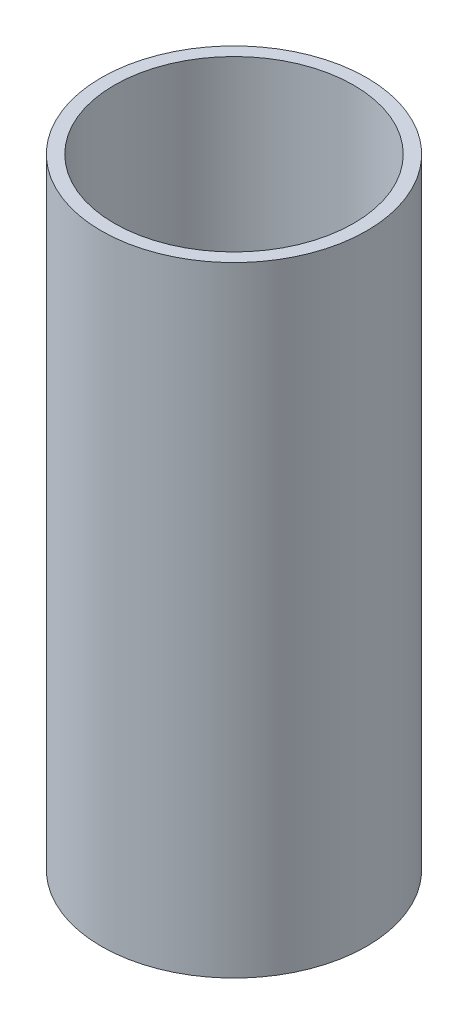
ISO-10303-21;
HEADER;
FILE_DESCRIPTION(('STEP AP214'),'2;1');
FILE_NAME('part.step','',(''),(''),'','','');
FILE_SCHEMA(('AUTOMOTIVE_DESIGN { 1 0 10303 214 1 1 1 1 }'));
ENDSEC;
DATA;
#1=APPLICATION_CONTEXT('core data for automotive mechanical design processes');
#2=APPLICATION_PROTOCOL_DEFINITION('international standard','automotive_design',2000,#1);
#3=PRODUCT_CONTEXT('',#1,'mechanical');
#4=PRODUCT('Part','Part','',(#3));
#5=PRODUCT_RELATED_PRODUCT_CATEGORY('part','',(#4));
#6=PRODUCT_DEFINITION_FORMATION('','',#4);
#7=PRODUCT_DEFINITION_CONTEXT('part definition',#1,'design');
#8=PRODUCT_DEFINITION('design','',#6,#7);
#9=PRODUCT_DEFINITION_SHAPE('','',#8);
#10=(LENGTH_UNIT() NAMED_UNIT(*) SI_UNIT(.MILLI.,.METRE.));
#11=(NAMED_UNIT(*) PLANE_ANGLE_UNIT() SI_UNIT($,.RADIAN.));
#12=(NAMED_UNIT(*) SI_UNIT($,.STERADIAN.) SOLID_ANGLE_UNIT());
#13=UNCERTAINTY_MEASURE_WITH_UNIT(LENGTH_MEASURE(1.E-05),#10,'distance_accuracy_value','');
#14=(GEOMETRIC_REPRESENTATION_CONTEXT(3) GLOBAL_UNCERTAINTY_ASSIGNED_CONTEXT((#13)) GLOBAL_UNIT_ASSIGNED_CONTEXT((#10,
#11,#12)) REPRESENTATION_CONTEXT('',''));
#15=CARTESIAN_POINT('',(0.,0.,0.));
#16=DIRECTION('',(0.,0.,1.));
#17=DIRECTION('',(1.,0.,0.));
#18=AXIS2_PLACEMENT_3D('',#15,#16,#17);
#19=CARTESIAN_POINT('',(0.,198.436822393788,0.));
#20=DIRECTION('',(0.,-1.,0.));
#21=DIRECTION('',(0.,0.,-1.));
#22=AXIS2_PLACEMENT_3D('',#19,#20,#21);
#23=CYLINDRICAL_SURFACE('',#22,42.5);
#24=CARTESIAN_POINT('',(0.,198.436822393788,0.));
#25=DIRECTION('',(0.,1.,0.));
#26=DIRECTION('',(0.,0.,1.));
#27=AXIS2_PLACEMENT_3D('',#24,#25,#26);
#28=CIRCLE('',#27,42.5);
#29=CARTESIAN_POINT('',(0.,198.436822393788,42.5));
#30=VERTEX_POINT('',#29);
#31=EDGE_CURVE('E10',#30,#30,#28,.T.);
#32=ORIENTED_EDGE('',*,*,#31,.F.);
#33=EDGE_LOOP('',(#32));
#34=FACE_BOUND('',#33,.T.);
#35=CARTESIAN_POINT('',(0.,0.,0.));
#36=DIRECTION('',(0.,1.,0.));
#37=DIRECTION('',(0.,0.,1.));
#38=AXIS2_PLACEMENT_3D('',#35,#36,#37);
#39=CIRCLE('',#38,42.5);
#40=CARTESIAN_POINT('',(0.,0.,42.5));
#41=VERTEX_POINT('',#40);
#42=EDGE_CURVE('E37',#41,#41,#39,.T.);
#43=ORIENTED_EDGE('',*,*,#42,.T.);
#44=EDGE_LOOP('',(#43));
#45=FACE_BOUND('',#44,.T.);
#46=ADVANCED_FACE('F40',(#34,#45),#23,.T.);
#47=CARTESIAN_POINT('',(0.,198.436822393788,0.));
#48=DIRECTION('',(0.,1.,0.));
#49=DIRECTION('',(0.,0.,1.));
#50=AXIS2_PLACEMENT_3D('',#47,#48,#49);
#51=PLANE('',#50);
#52=CARTESIAN_POINT('',(0.,198.436822393788,0.));
#53=DIRECTION('',(0.,1.,0.));
#54=DIRECTION('',(0.,0.,1.));
#55=AXIS2_PLACEMENT_3D('',#52,#53,#54);
#56=CIRCLE('',#55,38.335053037252);
#57=CARTESIAN_POINT('',(0.,198.436822393788,38.335053037252));
#58=VERTEX_POINT('',#57);
#59=EDGE_CURVE('E50',#58,#58,#56,.T.);
#60=ORIENTED_EDGE('',*,*,#59,.F.);
#61=EDGE_LOOP('',(#60));
#62=FACE_BOUND('',#61,.T.);
#63=ORIENTED_EDGE('',*,*,#31,.T.);
#64=EDGE_LOOP('',(#63));
#65=FACE_BOUND('',#64,.T.);
#66=ADVANCED_FACE('F59',(#62,#65),#51,.T.);
#67=CARTESIAN_POINT('',(0.,0.,0.));
#68=DIRECTION('',(0.,1.,0.));
#69=DIRECTION('',(0.,0.,1.));
#70=AXIS2_PLACEMENT_3D('',#67,#68,#69);
#71=PLANE('',#70);
#72=CARTESIAN_POINT('',(0.,0.,0.));
#73=DIRECTION('',(0.,1.,0.));
#74=DIRECTION('',(0.,0.,1.));
#75=AXIS2_PLACEMENT_3D('',#72,#73,#74);
#76=CIRCLE('',#75,38.335053037252);
#77=CARTESIAN_POINT('',(0.,0.,38.335053037252));
#78=VERTEX_POINT('',#77);
#79=EDGE_CURVE('E47',#78,#78,#76,.T.);
#80=ORIENTED_EDGE('',*,*,#79,.T.);
#81=EDGE_LOOP('',(#80));
#82=FACE_BOUND('',#81,.T.);
#83=ORIENTED_EDGE('',*,*,#42,.F.);
#84=EDGE_LOOP('',(#83));
#85=FACE_BOUND('',#84,.T.);
#86=ADVANCED_FACE('F58',(#82,#85),#71,.F.);
#87=CARTESIAN_POINT('',(0.,198.436822393788,0.));
#88=DIRECTION('',(0.,-1.,0.));
#89=DIRECTION('',(0.,0.,-1.));
#90=AXIS2_PLACEMENT_3D('',#87,#88,#89);
#91=CYLINDRICAL_SURFACE('',#90,38.335053037252);
#92=ORIENTED_EDGE('',*,*,#59,.T.);
#93=EDGE_LOOP('',(#92));
#94=FACE_BOUND('',#93,.T.);
#95=ORIENTED_EDGE('',*,*,#79,.F.);
#96=EDGE_LOOP('',(#95));
#97=FACE_BOUND('',#96,.T.);
#98=ADVANCED_FACE('F54',(#94,#97),#91,.F.);
#99=CLOSED_SHELL('',(#46,#66,#86,#98));
#100=MANIFOLD_SOLID_BREP('B2',#99);
#101=ADVANCED_BREP_SHAPE_REPRESENTATION('',(#18,#100),#14);
#102=SHAPE_DEFINITION_REPRESENTATION(#9,#101);
ENDSEC;
END-ISO-10303-21;
